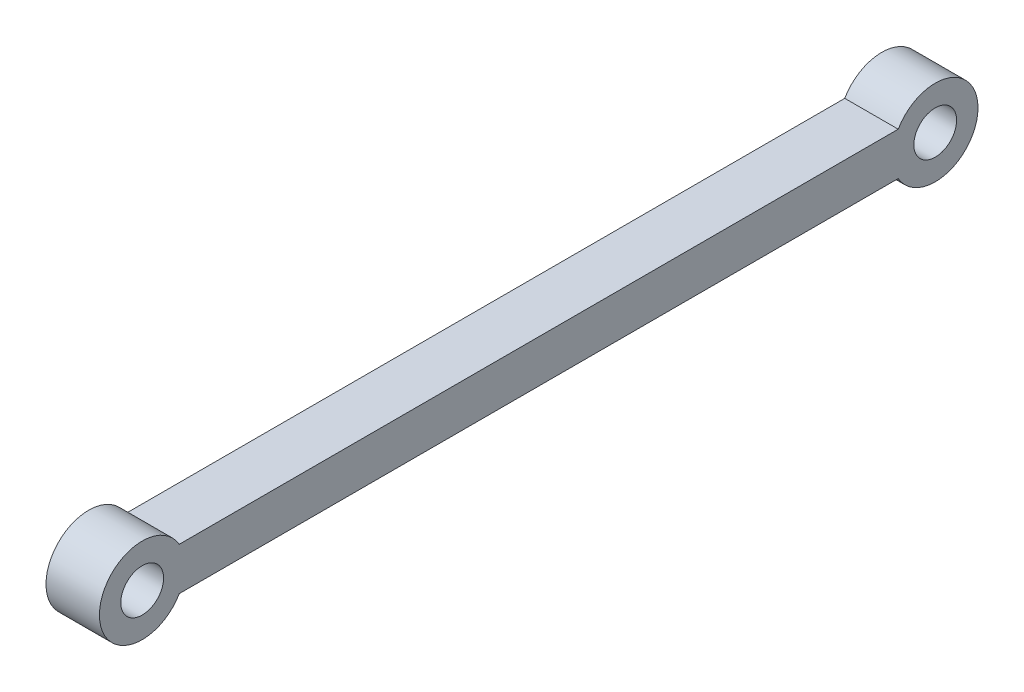
ISO-10303-21;
HEADER;
FILE_DESCRIPTION(('STEP AP214'),'2;1');
FILE_NAME('part.step','',(''),(''),'','','');
FILE_SCHEMA(('AUTOMOTIVE_DESIGN { 1 0 10303 214 1 1 1 1 }'));
ENDSEC;
DATA;
#1=APPLICATION_CONTEXT('core data for automotive mechanical design processes');
#2=APPLICATION_PROTOCOL_DEFINITION('international standard','automotive_design',2000,#1);
#3=PRODUCT_CONTEXT('',#1,'mechanical');
#4=PRODUCT('Part','Part','',(#3));
#5=PRODUCT_RELATED_PRODUCT_CATEGORY('part','',(#4));
#6=PRODUCT_DEFINITION_FORMATION('','',#4);
#7=PRODUCT_DEFINITION_CONTEXT('part definition',#1,'design');
#8=PRODUCT_DEFINITION('design','',#6,#7);
#9=PRODUCT_DEFINITION_SHAPE('','',#8);
#10=(LENGTH_UNIT() NAMED_UNIT(*) SI_UNIT(.MILLI.,.METRE.));
#11=(NAMED_UNIT(*) PLANE_ANGLE_UNIT() SI_UNIT($,.RADIAN.));
#12=(NAMED_UNIT(*) SI_UNIT($,.STERADIAN.) SOLID_ANGLE_UNIT());
#13=UNCERTAINTY_MEASURE_WITH_UNIT(LENGTH_MEASURE(1.E-05),#10,'distance_accuracy_value','');
#14=(GEOMETRIC_REPRESENTATION_CONTEXT(3) GLOBAL_UNCERTAINTY_ASSIGNED_CONTEXT((#13)) GLOBAL_UNIT_ASSIGNED_CONTEXT((#10,
#11,#12)) REPRESENTATION_CONTEXT('',''));
#15=CARTESIAN_POINT('',(0.,0.,0.));
#16=DIRECTION('',(0.,0.,1.));
#17=DIRECTION('',(1.,0.,0.));
#18=AXIS2_PLACEMENT_3D('',#15,#16,#17);
#19=CARTESIAN_POINT('',(1.25,0.,-18.5475));
#20=DIRECTION('',(1.,0.,0.));
#21=DIRECTION('',(0.,0.,-1.));
#22=AXIS2_PLACEMENT_3D('',#19,#20,#21);
#23=PLANE('',#22);
#24=CARTESIAN_POINT('',(1.25,0.,18.5475));
#25=DIRECTION('',(1.,0.,0.));
#26=DIRECTION('',(0.,0.,-1.));
#27=AXIS2_PLACEMENT_3D('',#24,#25,#26);
#28=CIRCLE('',#27,0.999999999999998);
#29=CARTESIAN_POINT('',(1.25,0.,17.5475));
#30=VERTEX_POINT('',#29);
#31=EDGE_CURVE('E108',#30,#30,#28,.T.);
#32=ORIENTED_EDGE('',*,*,#31,.F.);
#33=EDGE_LOOP('',(#32));
#34=FACE_BOUND('',#33,.T.);
#35=CARTESIAN_POINT('',(1.25,0.,-18.5475));
#36=DIRECTION('',(1.,0.,0.));
#37=DIRECTION('',(0.,0.,-1.));
#38=AXIS2_PLACEMENT_3D('',#35,#36,#37);
#39=CIRCLE('',#38,2.);
#40=CARTESIAN_POINT('',(1.25,-1.,-16.8154491924311));
#41=VERTEX_POINT('',#40);
#42=CARTESIAN_POINT('',(1.25,1.,-16.8154491924311));
#43=VERTEX_POINT('',#42);
#44=EDGE_CURVE('E93',#41,#43,#39,.T.);
#45=ORIENTED_EDGE('',*,*,#44,.T.);
#46=DIRECTION('',(0.,0.,1.));
#47=VECTOR('',#46,1.);
#48=CARTESIAN_POINT('',(1.25,1.,16.8154491924311));
#49=LINE('',#48,#47);
#50=CARTESIAN_POINT('',(1.25,1.,16.8154491924311));
#51=VERTEX_POINT('',#50);
#52=EDGE_CURVE('E88',#43,#51,#49,.T.);
#53=ORIENTED_EDGE('',*,*,#52,.T.);
#54=CARTESIAN_POINT('',(1.25,0.,18.5475));
#55=DIRECTION('',(1.,0.,0.));
#56=DIRECTION('',(0.,0.,-1.));
#57=AXIS2_PLACEMENT_3D('',#54,#55,#56);
#58=CIRCLE('',#57,2.);
#59=CARTESIAN_POINT('',(1.25,-1.,16.8154491924311));
#60=VERTEX_POINT('',#59);
#61=EDGE_CURVE('E91',#51,#60,#58,.T.);
#62=ORIENTED_EDGE('',*,*,#61,.T.);
#63=DIRECTION('',(0.,0.,-1.));
#64=VECTOR('',#63,1.);
#65=CARTESIAN_POINT('',(1.25,-1.,16.8154491924311));
#66=LINE('',#65,#64);
#67=EDGE_CURVE('E58',#60,#41,#66,.T.);
#68=ORIENTED_EDGE('',*,*,#67,.T.);
#69=EDGE_LOOP('',(#45,#53,#62,#68));
#70=FACE_BOUND('',#69,.T.);
#71=CARTESIAN_POINT('',(1.25,0.,-18.5475));
#72=DIRECTION('',(1.,0.,0.));
#73=DIRECTION('',(0.,0.,-1.));
#74=AXIS2_PLACEMENT_3D('',#71,#72,#73);
#75=CIRCLE('',#74,0.999999999999998);
#76=CARTESIAN_POINT('',(1.25,0.,-19.5475));
#77=VERTEX_POINT('',#76);
#78=EDGE_CURVE('E123',#77,#77,#75,.T.);
#79=ORIENTED_EDGE('',*,*,#78,.F.);
#80=EDGE_LOOP('',(#79));
#81=FACE_BOUND('',#80,.T.);
#82=ADVANCED_FACE('F41',(#34,#70,#81),#23,.T.);
#83=CARTESIAN_POINT('',(-1.25,0.,-18.5475));
#84=DIRECTION('',(1.,0.,0.));
#85=DIRECTION('',(0.,0.,-1.));
#86=AXIS2_PLACEMENT_3D('',#83,#84,#85);
#87=PLANE('',#86);
#88=CARTESIAN_POINT('',(-1.25,0.,-18.5475));
#89=DIRECTION('',(1.,0.,0.));
#90=DIRECTION('',(0.,0.,-1.));
#91=AXIS2_PLACEMENT_3D('',#88,#89,#90);
#92=CIRCLE('',#91,2.);
#93=CARTESIAN_POINT('',(-1.25,-1.,-16.8154491924311));
#94=VERTEX_POINT('',#93);
#95=CARTESIAN_POINT('',(-1.25,1.,-16.8154491924311));
#96=VERTEX_POINT('',#95);
#97=EDGE_CURVE('E105',#94,#96,#92,.T.);
#98=ORIENTED_EDGE('',*,*,#97,.F.);
#99=DIRECTION('',(0.,0.,-1.));
#100=VECTOR('',#99,1.);
#101=CARTESIAN_POINT('',(-1.25,-1.,16.8154491924311));
#102=LINE('',#101,#100);
#103=CARTESIAN_POINT('',(-1.25,-1.,16.8154491924311));
#104=VERTEX_POINT('',#103);
#105=EDGE_CURVE('E81',#104,#94,#102,.T.);
#106=ORIENTED_EDGE('',*,*,#105,.F.);
#107=CARTESIAN_POINT('',(-1.25,0.,18.5475));
#108=DIRECTION('',(1.,0.,0.));
#109=DIRECTION('',(0.,0.,-1.));
#110=AXIS2_PLACEMENT_3D('',#107,#108,#109);
#111=CIRCLE('',#110,2.);
#112=CARTESIAN_POINT('',(-1.25,1.,16.8154491924311));
#113=VERTEX_POINT('',#112);
#114=EDGE_CURVE('E75',#113,#104,#111,.T.);
#115=ORIENTED_EDGE('',*,*,#114,.F.);
#116=DIRECTION('',(0.,0.,1.));
#117=VECTOR('',#116,1.);
#118=CARTESIAN_POINT('',(-1.25,1.,16.8154491924311));
#119=LINE('',#118,#117);
#120=EDGE_CURVE('E97',#96,#113,#119,.T.);
#121=ORIENTED_EDGE('',*,*,#120,.F.);
#122=EDGE_LOOP('',(#98,#106,#115,#121));
#123=FACE_BOUND('',#122,.T.);
#124=CARTESIAN_POINT('',(-1.25,0.,18.5475));
#125=DIRECTION('',(1.,0.,0.));
#126=DIRECTION('',(0.,0.,-1.));
#127=AXIS2_PLACEMENT_3D('',#124,#125,#126);
#128=CIRCLE('',#127,0.999999999999998);
#129=CARTESIAN_POINT('',(-1.25,0.,17.5475));
#130=VERTEX_POINT('',#129);
#131=EDGE_CURVE('E120',#130,#130,#128,.T.);
#132=ORIENTED_EDGE('',*,*,#131,.T.);
#133=EDGE_LOOP('',(#132));
#134=FACE_BOUND('',#133,.T.);
#135=CARTESIAN_POINT('',(-1.25,0.,-18.5475));
#136=DIRECTION('',(1.,0.,0.));
#137=DIRECTION('',(0.,0.,-1.));
#138=AXIS2_PLACEMENT_3D('',#135,#136,#137);
#139=CIRCLE('',#138,0.999999999999998);
#140=CARTESIAN_POINT('',(-1.25,0.,-19.5475));
#141=VERTEX_POINT('',#140);
#142=EDGE_CURVE('E126',#141,#141,#139,.T.);
#143=ORIENTED_EDGE('',*,*,#142,.T.);
#144=EDGE_LOOP('',(#143));
#145=FACE_BOUND('',#144,.T.);
#146=ADVANCED_FACE('F116',(#123,#134,#145),#87,.F.);
#147=CARTESIAN_POINT('',(1.25,0.,-18.5475));
#148=DIRECTION('',(-1.,0.,0.));
#149=DIRECTION('',(0.,0.,1.));
#150=AXIS2_PLACEMENT_3D('',#147,#148,#149);
#151=CYLINDRICAL_SURFACE('',#150,2.);
#152=ORIENTED_EDGE('',*,*,#97,.T.);
#153=DIRECTION('',(-1.,0.,0.));
#154=VECTOR('',#153,1.);
#155=CARTESIAN_POINT('',(1.25,1.,-16.8154491924311));
#156=LINE('',#155,#154);
#157=EDGE_CURVE('E11',#43,#96,#156,.T.);
#158=ORIENTED_EDGE('',*,*,#157,.F.);
#159=ORIENTED_EDGE('',*,*,#44,.F.);
#160=DIRECTION('',(-1.,0.,0.));
#161=VECTOR('',#160,1.);
#162=CARTESIAN_POINT('',(1.25,-1.,-16.8154491924311));
#163=LINE('',#162,#161);
#164=EDGE_CURVE('E101',#41,#94,#163,.T.);
#165=ORIENTED_EDGE('',*,*,#164,.T.);
#166=EDGE_LOOP('',(#152,#158,#159,#165));
#167=FACE_BOUND('',#166,.T.);
#168=ADVANCED_FACE('F43',(#167),#151,.T.);
#169=CARTESIAN_POINT('',(1.25,1.,16.8154491924311));
#170=DIRECTION('',(0.,-1.,0.));
#171=DIRECTION('',(0.,0.,-1.));
#172=AXIS2_PLACEMENT_3D('',#169,#170,#171);
#173=PLANE('',#172);
#174=ORIENTED_EDGE('',*,*,#120,.T.);
#175=DIRECTION('',(-1.,0.,0.));
#176=VECTOR('',#175,1.);
#177=CARTESIAN_POINT('',(1.25,1.,16.8154491924311));
#178=LINE('',#177,#176);
#179=EDGE_CURVE('E50',#51,#113,#178,.T.);
#180=ORIENTED_EDGE('',*,*,#179,.F.);
#181=ORIENTED_EDGE('',*,*,#52,.F.);
#182=ORIENTED_EDGE('',*,*,#157,.T.);
#183=EDGE_LOOP('',(#174,#180,#181,#182));
#184=FACE_BOUND('',#183,.T.);
#185=ADVANCED_FACE('F96',(#184),#173,.F.);
#186=CARTESIAN_POINT('',(1.25,0.,18.5475));
#187=DIRECTION('',(-1.,0.,0.));
#188=DIRECTION('',(0.,0.,1.));
#189=AXIS2_PLACEMENT_3D('',#186,#187,#188);
#190=CYLINDRICAL_SURFACE('',#189,2.);
#191=ORIENTED_EDGE('',*,*,#114,.T.);
#192=DIRECTION('',(-1.,0.,0.));
#193=VECTOR('',#192,1.);
#194=CARTESIAN_POINT('',(1.25,-1.,16.8154491924311));
#195=LINE('',#194,#193);
#196=EDGE_CURVE('E98',#60,#104,#195,.T.);
#197=ORIENTED_EDGE('',*,*,#196,.F.);
#198=ORIENTED_EDGE('',*,*,#61,.F.);
#199=ORIENTED_EDGE('',*,*,#179,.T.);
#200=EDGE_LOOP('',(#191,#197,#198,#199));
#201=FACE_BOUND('',#200,.T.);
#202=ADVANCED_FACE('F99',(#201),#190,.T.);
#203=CARTESIAN_POINT('',(1.25,-1.,16.8154491924311));
#204=DIRECTION('',(0.,1.,0.));
#205=DIRECTION('',(0.,0.,1.));
#206=AXIS2_PLACEMENT_3D('',#203,#204,#205);
#207=PLANE('',#206);
#208=ORIENTED_EDGE('',*,*,#105,.T.);
#209=ORIENTED_EDGE('',*,*,#164,.F.);
#210=ORIENTED_EDGE('',*,*,#67,.F.);
#211=ORIENTED_EDGE('',*,*,#196,.T.);
#212=EDGE_LOOP('',(#208,#209,#210,#211));
#213=FACE_BOUND('',#212,.T.);
#214=ADVANCED_FACE('F113',(#213),#207,.F.);
#215=CARTESIAN_POINT('',(1.25,0.,18.5475));
#216=DIRECTION('',(-1.,0.,0.));
#217=DIRECTION('',(0.,0.,1.));
#218=AXIS2_PLACEMENT_3D('',#215,#216,#217);
#219=CYLINDRICAL_SURFACE('',#218,0.999999999999998);
#220=ORIENTED_EDGE('',*,*,#31,.T.);
#221=EDGE_LOOP('',(#220));
#222=FACE_BOUND('',#221,.T.);
#223=ORIENTED_EDGE('',*,*,#131,.F.);
#224=EDGE_LOOP('',(#223));
#225=FACE_BOUND('',#224,.T.);
#226=ADVANCED_FACE('F143',(#222,#225),#219,.F.);
#227=CARTESIAN_POINT('',(1.25,0.,-18.5475));
#228=DIRECTION('',(-1.,0.,0.));
#229=DIRECTION('',(0.,0.,1.));
#230=AXIS2_PLACEMENT_3D('',#227,#228,#229);
#231=CYLINDRICAL_SURFACE('',#230,0.999999999999998);
#232=ORIENTED_EDGE('',*,*,#78,.T.);
#233=EDGE_LOOP('',(#232));
#234=FACE_BOUND('',#233,.T.);
#235=ORIENTED_EDGE('',*,*,#142,.F.);
#236=EDGE_LOOP('',(#235));
#237=FACE_BOUND('',#236,.T.);
#238=ADVANCED_FACE('F132',(#234,#237),#231,.F.);
#239=CLOSED_SHELL('',(#82,#146,#168,#185,#202,#214,#226,#238));
#240=MANIFOLD_SOLID_BREP('B2',#239);
#241=ADVANCED_BREP_SHAPE_REPRESENTATION('',(#18,#240),#14);
#242=SHAPE_DEFINITION_REPRESENTATION(#9,#241);
ENDSEC;
END-ISO-10303-21;
